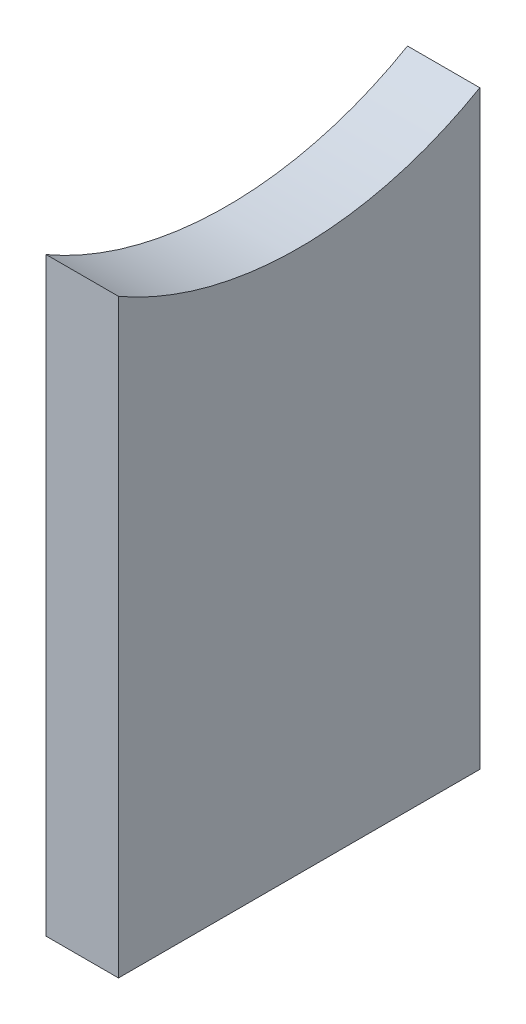
ISO-10303-21;
HEADER;
FILE_DESCRIPTION(('STEP AP214'),'2;1');
FILE_NAME('part.step','',(''),(''),'','','');
FILE_SCHEMA(('AUTOMOTIVE_DESIGN { 1 0 10303 214 1 1 1 1 }'));
ENDSEC;
DATA;
#1=APPLICATION_CONTEXT('core data for automotive mechanical design processes');
#2=APPLICATION_PROTOCOL_DEFINITION('international standard','automotive_design',2000,#1);
#3=PRODUCT_CONTEXT('',#1,'mechanical');
#4=PRODUCT('Part','Part','',(#3));
#5=PRODUCT_RELATED_PRODUCT_CATEGORY('part','',(#4));
#6=PRODUCT_DEFINITION_FORMATION('','',#4);
#7=PRODUCT_DEFINITION_CONTEXT('part definition',#1,'design');
#8=PRODUCT_DEFINITION('design','',#6,#7);
#9=PRODUCT_DEFINITION_SHAPE('','',#8);
#10=(LENGTH_UNIT() NAMED_UNIT(*) SI_UNIT(.MILLI.,.METRE.));
#11=(NAMED_UNIT(*) PLANE_ANGLE_UNIT() SI_UNIT($,.RADIAN.));
#12=(NAMED_UNIT(*) SI_UNIT($,.STERADIAN.) SOLID_ANGLE_UNIT());
#13=UNCERTAINTY_MEASURE_WITH_UNIT(LENGTH_MEASURE(1.E-05),#10,'distance_accuracy_value','');
#14=(GEOMETRIC_REPRESENTATION_CONTEXT(3) GLOBAL_UNCERTAINTY_ASSIGNED_CONTEXT((#13)) GLOBAL_UNIT_ASSIGNED_CONTEXT((#10,
#11,#12)) REPRESENTATION_CONTEXT('',''));
#15=CARTESIAN_POINT('',(0.,0.,0.));
#16=DIRECTION('',(0.,0.,1.));
#17=DIRECTION('',(1.,0.,0.));
#18=AXIS2_PLACEMENT_3D('',#15,#16,#17);
#19=CARTESIAN_POINT('',(5.08,0.,0.));
#20=DIRECTION('',(0.,0.,-1.));
#21=DIRECTION('',(-1.,0.,0.));
#22=AXIS2_PLACEMENT_3D('',#19,#20,#21);
#23=PLANE('',#22);
#24=DIRECTION('',(0.,-1.,0.));
#25=VECTOR('',#24,1.);
#26=CARTESIAN_POINT('',(0.,0.,0.));
#27=LINE('',#26,#25);
#28=CARTESIAN_POINT('',(0.,41.5029547438753,0.));
#29=VERTEX_POINT('',#28);
#30=CARTESIAN_POINT('',(0.,0.,0.));
#31=VERTEX_POINT('',#30);
#32=EDGE_CURVE('E95',#29,#31,#27,.T.);
#33=ORIENTED_EDGE('',*,*,#32,.T.);
#34=DIRECTION('',(-1.,0.,0.));
#35=VECTOR('',#34,1.);
#36=CARTESIAN_POINT('',(5.08,0.,0.));
#37=LINE('',#36,#35);
#38=CARTESIAN_POINT('',(5.08,0.,0.));
#39=VERTEX_POINT('',#38);
#40=EDGE_CURVE('E11',#39,#31,#37,.T.);
#41=ORIENTED_EDGE('',*,*,#40,.F.);
#42=DIRECTION('',(0.,-1.,0.));
#43=VECTOR('',#42,1.);
#44=CARTESIAN_POINT('',(5.08,0.,0.));
#45=LINE('',#44,#43);
#46=CARTESIAN_POINT('',(5.08,41.5029547438753,0.));
#47=VERTEX_POINT('',#46);
#48=EDGE_CURVE('E83',#47,#39,#45,.T.);
#49=ORIENTED_EDGE('',*,*,#48,.F.);
#50=DIRECTION('',(-1.,0.,0.));
#51=VECTOR('',#50,1.);
#52=CARTESIAN_POINT('',(5.08,41.5029547438753,0.));
#53=LINE('',#52,#51);
#54=EDGE_CURVE('E91',#47,#29,#53,.T.);
#55=ORIENTED_EDGE('',*,*,#54,.T.);
#56=EDGE_LOOP('',(#33,#41,#49,#55));
#57=FACE_BOUND('',#56,.T.);
#58=ADVANCED_FACE('F32',(#57),#23,.F.);
#59=CARTESIAN_POINT('',(5.08,0.,0.));
#60=DIRECTION('',(0.,1.,0.));
#61=DIRECTION('',(0.,0.,1.));
#62=AXIS2_PLACEMENT_3D('',#59,#60,#61);
#63=PLANE('',#62);
#64=DIRECTION('',(0.,0.,-1.));
#65=VECTOR('',#64,1.);
#66=CARTESIAN_POINT('',(0.,0.,0.));
#67=LINE('',#66,#65);
#68=CARTESIAN_POINT('',(0.,0.,-25.4));
#69=VERTEX_POINT('',#68);
#70=EDGE_CURVE('E87',#31,#69,#67,.T.);
#71=ORIENTED_EDGE('',*,*,#70,.T.);
#72=DIRECTION('',(-1.,0.,0.));
#73=VECTOR('',#72,1.);
#74=CARTESIAN_POINT('',(5.08,0.,-25.4));
#75=LINE('',#74,#73);
#76=CARTESIAN_POINT('',(5.08,0.,-25.4));
#77=VERTEX_POINT('',#76);
#78=EDGE_CURVE('E40',#77,#69,#75,.T.);
#79=ORIENTED_EDGE('',*,*,#78,.F.);
#80=DIRECTION('',(0.,0.,-1.));
#81=VECTOR('',#80,1.);
#82=CARTESIAN_POINT('',(5.08,0.,0.));
#83=LINE('',#82,#81);
#84=EDGE_CURVE('E78',#39,#77,#83,.T.);
#85=ORIENTED_EDGE('',*,*,#84,.F.);
#86=ORIENTED_EDGE('',*,*,#40,.T.);
#87=EDGE_LOOP('',(#71,#79,#85,#86));
#88=FACE_BOUND('',#87,.T.);
#89=ADVANCED_FACE('F86',(#88),#63,.F.);
#90=CARTESIAN_POINT('',(5.08,0.,-25.4));
#91=DIRECTION('',(0.,0.,1.));
#92=DIRECTION('',(0.,-1.,0.));
#93=AXIS2_PLACEMENT_3D('',#90,#91,#92);
#94=PLANE('',#93);
#95=DIRECTION('',(0.,1.,0.));
#96=VECTOR('',#95,1.);
#97=CARTESIAN_POINT('',(0.,0.,-25.4));
#98=LINE('',#97,#96);
#99=CARTESIAN_POINT('',(0.,41.5029547438753,-25.4));
#100=VERTEX_POINT('',#99);
#101=EDGE_CURVE('E65',#69,#100,#98,.T.);
#102=ORIENTED_EDGE('',*,*,#101,.T.);
#103=DIRECTION('',(-1.,0.,0.));
#104=VECTOR('',#103,1.);
#105=CARTESIAN_POINT('',(5.08,41.5029547438753,-25.4));
#106=LINE('',#105,#104);
#107=CARTESIAN_POINT('',(5.08,41.5029547438753,-25.4));
#108=VERTEX_POINT('',#107);
#109=EDGE_CURVE('E88',#108,#100,#106,.T.);
#110=ORIENTED_EDGE('',*,*,#109,.F.);
#111=DIRECTION('',(0.,1.,0.));
#112=VECTOR('',#111,1.);
#113=CARTESIAN_POINT('',(5.08,0.,-25.4));
#114=LINE('',#113,#112);
#115=EDGE_CURVE('E81',#77,#108,#114,.T.);
#116=ORIENTED_EDGE('',*,*,#115,.F.);
#117=ORIENTED_EDGE('',*,*,#78,.T.);
#118=EDGE_LOOP('',(#102,#110,#116,#117));
#119=FACE_BOUND('',#118,.T.);
#120=ADVANCED_FACE('F89',(#119),#94,.F.);
#121=CARTESIAN_POINT('',(5.08,63.5,-12.7));
#122=DIRECTION('',(-1.,0.,0.));
#123=DIRECTION('',(0.,0.,1.));
#124=AXIS2_PLACEMENT_3D('',#121,#122,#123);
#125=CYLINDRICAL_SURFACE('',#124,25.4);
#126=CARTESIAN_POINT('',(0.,63.5,-12.7));
#127=DIRECTION('',(-1.,0.,0.));
#128=DIRECTION('',(0.,0.,-1.));
#129=AXIS2_PLACEMENT_3D('',#126,#127,#128);
#130=CIRCLE('',#129,25.4);
#131=EDGE_CURVE('E71',#100,#29,#130,.T.);
#132=ORIENTED_EDGE('',*,*,#131,.T.);
#133=ORIENTED_EDGE('',*,*,#54,.F.);
#134=CARTESIAN_POINT('',(5.08,63.5,-12.7));
#135=DIRECTION('',(-1.,0.,0.));
#136=DIRECTION('',(0.,0.,-1.));
#137=AXIS2_PLACEMENT_3D('',#134,#135,#136);
#138=CIRCLE('',#137,25.4);
#139=EDGE_CURVE('E48',#108,#47,#138,.T.);
#140=ORIENTED_EDGE('',*,*,#139,.F.);
#141=ORIENTED_EDGE('',*,*,#109,.T.);
#142=EDGE_LOOP('',(#132,#133,#140,#141));
#143=FACE_BOUND('',#142,.T.);
#144=ADVANCED_FACE('F102',(#143),#125,.F.);
#145=CARTESIAN_POINT('',(5.08,63.5,-12.7));
#146=DIRECTION('',(1.,0.,0.));
#147=DIRECTION('',(0.,0.,-1.));
#148=AXIS2_PLACEMENT_3D('',#145,#146,#147);
#149=PLANE('',#148);
#150=ORIENTED_EDGE('',*,*,#48,.T.);
#151=ORIENTED_EDGE('',*,*,#84,.T.);
#152=ORIENTED_EDGE('',*,*,#115,.T.);
#153=ORIENTED_EDGE('',*,*,#139,.T.);
#154=EDGE_LOOP('',(#150,#151,#152,#153));
#155=FACE_BOUND('',#154,.T.);
#156=ADVANCED_FACE('F79',(#155),#149,.T.);
#157=CARTESIAN_POINT('',(0.,63.5,-12.7));
#158=DIRECTION('',(1.,0.,0.));
#159=DIRECTION('',(0.,0.,-1.));
#160=AXIS2_PLACEMENT_3D('',#157,#158,#159);
#161=PLANE('',#160);
#162=ORIENTED_EDGE('',*,*,#32,.F.);
#163=ORIENTED_EDGE('',*,*,#131,.F.);
#164=ORIENTED_EDGE('',*,*,#101,.F.);
#165=ORIENTED_EDGE('',*,*,#70,.F.);
#166=EDGE_LOOP('',(#162,#163,#164,#165));
#167=FACE_BOUND('',#166,.T.);
#168=ADVANCED_FACE('F105',(#167),#161,.F.);
#169=CLOSED_SHELL('',(#58,#89,#120,#144,#156,#168));
#170=MANIFOLD_SOLID_BREP('B2',#169);
#171=ADVANCED_BREP_SHAPE_REPRESENTATION('',(#18,#170),#14);
#172=SHAPE_DEFINITION_REPRESENTATION(#9,#171);
ENDSEC;
END-ISO-10303-21;
